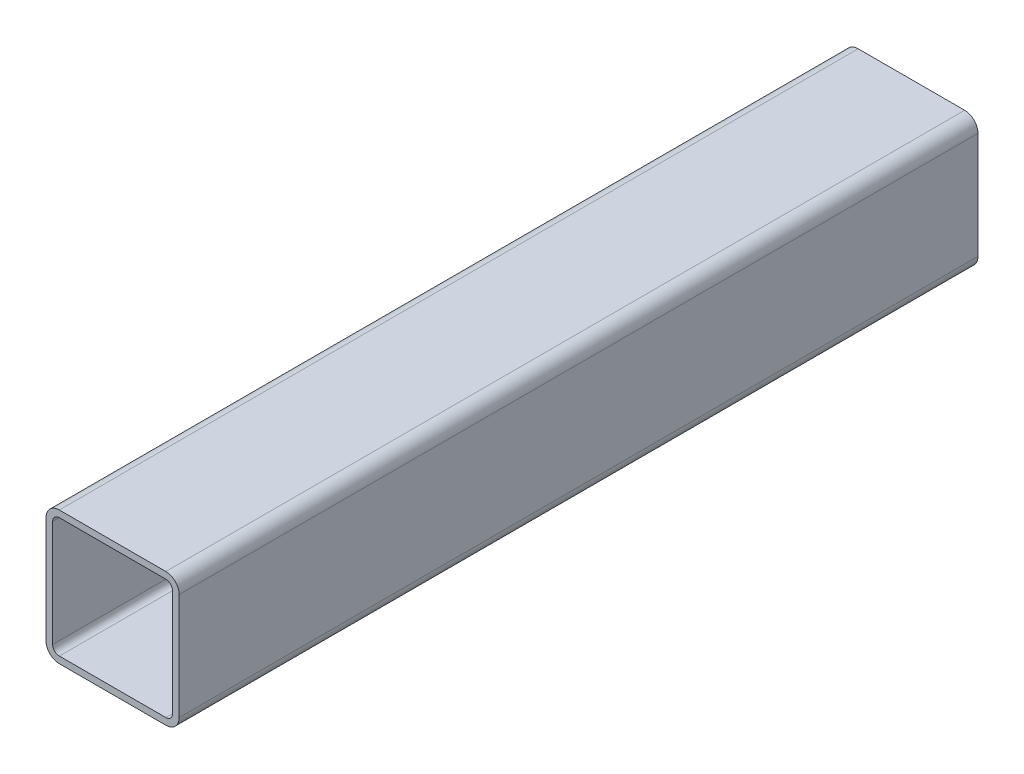
ISO-10303-21;
HEADER;
FILE_DESCRIPTION(('STEP AP214'),'2;1');
FILE_NAME('part.step','',(''),(''),'','','');
FILE_SCHEMA(('AUTOMOTIVE_DESIGN { 1 0 10303 214 1 1 1 1 }'));
ENDSEC;
DATA;
#1=APPLICATION_CONTEXT('core data for automotive mechanical design processes');
#2=APPLICATION_PROTOCOL_DEFINITION('international standard','automotive_design',2000,#1);
#3=PRODUCT_CONTEXT('',#1,'mechanical');
#4=PRODUCT('Part','Part','',(#3));
#5=PRODUCT_RELATED_PRODUCT_CATEGORY('part','',(#4));
#6=PRODUCT_DEFINITION_FORMATION('','',#4);
#7=PRODUCT_DEFINITION_CONTEXT('part definition',#1,'design');
#8=PRODUCT_DEFINITION('design','',#6,#7);
#9=PRODUCT_DEFINITION_SHAPE('','',#8);
#10=(LENGTH_UNIT() NAMED_UNIT(*) SI_UNIT(.MILLI.,.METRE.));
#11=(NAMED_UNIT(*) PLANE_ANGLE_UNIT() SI_UNIT($,.RADIAN.));
#12=(NAMED_UNIT(*) SI_UNIT($,.STERADIAN.) SOLID_ANGLE_UNIT());
#13=UNCERTAINTY_MEASURE_WITH_UNIT(LENGTH_MEASURE(1.E-05),#10,'distance_accuracy_value','');
#14=(GEOMETRIC_REPRESENTATION_CONTEXT(3) GLOBAL_UNCERTAINTY_ASSIGNED_CONTEXT((#13)) GLOBAL_UNIT_ASSIGNED_CONTEXT((#10,
#11,#12)) REPRESENTATION_CONTEXT('',''));
#15=CARTESIAN_POINT('',(0.,0.,0.));
#16=DIRECTION('',(0.,0.,1.));
#17=DIRECTION('',(1.,0.,0.));
#18=AXIS2_PLACEMENT_3D('',#15,#16,#17);
#19=CARTESIAN_POINT('',(-40.,40.,300.));
#20=DIRECTION('',(0.,0.,1.));
#21=DIRECTION('',(1.,0.,0.));
#22=AXIS2_PLACEMENT_3D('',#19,#20,#21);
#23=PLANE('',#22);
#24=CARTESIAN_POINT('',(-40.,40.,300.));
#25=DIRECTION('',(0.,0.,1.));
#26=DIRECTION('',(1.,0.,0.));
#27=AXIS2_PLACEMENT_3D('',#24,#25,#26);
#28=CIRCLE('',#27,10.);
#29=CARTESIAN_POINT('',(-40.,50.,300.));
#30=VERTEX_POINT('',#29);
#31=CARTESIAN_POINT('',(-50.,40.,300.));
#32=VERTEX_POINT('',#31);
#33=EDGE_CURVE('E214',#30,#32,#28,.T.);
#34=ORIENTED_EDGE('',*,*,#33,.T.);
#35=DIRECTION('',(0.,-1.,0.));
#36=VECTOR('',#35,1.);
#37=CARTESIAN_POINT('',(-50.,40.,300.));
#38=LINE('',#37,#36);
#39=CARTESIAN_POINT('',(-50.,-40.0000000000001,300.));
#40=VERTEX_POINT('',#39);
#41=EDGE_CURVE('E217',#32,#40,#38,.T.);
#42=ORIENTED_EDGE('',*,*,#41,.T.);
#43=CARTESIAN_POINT('',(-40.,-40.0000000000001,300.));
#44=DIRECTION('',(0.,0.,1.));
#45=DIRECTION('',(1.,0.,0.));
#46=AXIS2_PLACEMENT_3D('',#43,#44,#45);
#47=CIRCLE('',#46,10.);
#48=CARTESIAN_POINT('',(-40.,-50.0000000000001,300.));
#49=VERTEX_POINT('',#48);
#50=EDGE_CURVE('E220',#40,#49,#47,.T.);
#51=ORIENTED_EDGE('',*,*,#50,.T.);
#52=DIRECTION('',(1.,0.,0.));
#53=VECTOR('',#52,1.);
#54=CARTESIAN_POINT('',(-40.,-50.0000000000001,300.));
#55=LINE('',#54,#53);
#56=CARTESIAN_POINT('',(39.9999999999999,-50.0000000000001,300.));
#57=VERTEX_POINT('',#56);
#58=EDGE_CURVE('E222',#49,#57,#55,.T.);
#59=ORIENTED_EDGE('',*,*,#58,.T.);
#60=CARTESIAN_POINT('',(39.9999999999999,-40.0000000000001,300.));
#61=DIRECTION('',(0.,0.,1.));
#62=DIRECTION('',(1.,0.,0.));
#63=AXIS2_PLACEMENT_3D('',#60,#61,#62);
#64=CIRCLE('',#63,10.);
#65=CARTESIAN_POINT('',(50.,-40.0000000000001,300.));
#66=VERTEX_POINT('',#65);
#67=EDGE_CURVE('E224',#57,#66,#64,.T.);
#68=ORIENTED_EDGE('',*,*,#67,.T.);
#69=DIRECTION('',(0.,1.,0.));
#70=VECTOR('',#69,1.);
#71=CARTESIAN_POINT('',(50.,-40.0000000000001,300.));
#72=LINE('',#71,#70);
#73=CARTESIAN_POINT('',(50.,40.,300.));
#74=VERTEX_POINT('',#73);
#75=EDGE_CURVE('E226',#66,#74,#72,.T.);
#76=ORIENTED_EDGE('',*,*,#75,.T.);
#77=CARTESIAN_POINT('',(39.9999999999999,40.,300.));
#78=DIRECTION('',(0.,0.,1.));
#79=DIRECTION('',(1.,0.,0.));
#80=AXIS2_PLACEMENT_3D('',#77,#78,#79);
#81=CIRCLE('',#80,10.);
#82=CARTESIAN_POINT('',(39.9999999999999,50.,300.));
#83=VERTEX_POINT('',#82);
#84=EDGE_CURVE('E228',#74,#83,#81,.T.);
#85=ORIENTED_EDGE('',*,*,#84,.T.);
#86=DIRECTION('',(-1.,0.,0.));
#87=VECTOR('',#86,1.);
#88=CARTESIAN_POINT('',(39.9999999999999,50.,300.));
#89=LINE('',#88,#87);
#90=EDGE_CURVE('E230',#83,#30,#89,.T.);
#91=ORIENTED_EDGE('',*,*,#90,.T.);
#92=EDGE_LOOP('',(#34,#42,#51,#59,#68,#76,#85,#91));
#93=FACE_BOUND('',#92,.T.);
#94=DIRECTION('',(-1.,0.,0.));
#95=VECTOR('',#94,1.);
#96=CARTESIAN_POINT('',(39.9999999999999,45.,300.));
#97=LINE('',#96,#95);
#98=CARTESIAN_POINT('',(39.9999999999999,45.,300.));
#99=VERTEX_POINT('',#98);
#100=CARTESIAN_POINT('',(-40.,45.,300.));
#101=VERTEX_POINT('',#100);
#102=EDGE_CURVE('E157',#99,#101,#97,.T.);
#103=ORIENTED_EDGE('',*,*,#102,.F.);
#104=CARTESIAN_POINT('',(39.9999999999999,40.,300.));
#105=DIRECTION('',(0.,0.,1.));
#106=DIRECTION('',(1.,0.,0.));
#107=AXIS2_PLACEMENT_3D('',#104,#105,#106);
#108=CIRCLE('',#107,5.00000000000002);
#109=CARTESIAN_POINT('',(45.,40.,300.));
#110=VERTEX_POINT('',#109);
#111=EDGE_CURVE('E149',#110,#99,#108,.T.);
#112=ORIENTED_EDGE('',*,*,#111,.F.);
#113=DIRECTION('',(0.,1.,0.));
#114=VECTOR('',#113,1.);
#115=CARTESIAN_POINT('',(45.,-40.0000000000001,300.));
#116=LINE('',#115,#114);
#117=CARTESIAN_POINT('',(44.9999999999999,-40.0000000000001,300.));
#118=VERTEX_POINT('',#117);
#119=EDGE_CURVE('E182',#118,#110,#116,.T.);
#120=ORIENTED_EDGE('',*,*,#119,.F.);
#121=CARTESIAN_POINT('',(39.9999999999999,-40.0000000000001,300.));
#122=DIRECTION('',(0.,0.,1.));
#123=DIRECTION('',(1.,0.,0.));
#124=AXIS2_PLACEMENT_3D('',#121,#122,#123);
#125=CIRCLE('',#124,5.00000000000001);
#126=CARTESIAN_POINT('',(39.9999999999999,-45.0000000000001,300.));
#127=VERTEX_POINT('',#126);
#128=EDGE_CURVE('E180',#127,#118,#125,.T.);
#129=ORIENTED_EDGE('',*,*,#128,.F.);
#130=DIRECTION('',(1.,0.,0.));
#131=VECTOR('',#130,1.);
#132=CARTESIAN_POINT('',(-40.,-45.0000000000001,300.));
#133=LINE('',#132,#131);
#134=CARTESIAN_POINT('',(-40.,-45.0000000000001,300.));
#135=VERTEX_POINT('',#134);
#136=EDGE_CURVE('E178',#135,#127,#133,.T.);
#137=ORIENTED_EDGE('',*,*,#136,.F.);
#138=CARTESIAN_POINT('',(-40.,-40.0000000000001,300.));
#139=DIRECTION('',(0.,0.,1.));
#140=DIRECTION('',(1.,0.,0.));
#141=AXIS2_PLACEMENT_3D('',#138,#139,#140);
#142=CIRCLE('',#141,5.00000000000001);
#143=CARTESIAN_POINT('',(-45.,-40.0000000000001,300.));
#144=VERTEX_POINT('',#143);
#145=EDGE_CURVE('E176',#144,#135,#142,.T.);
#146=ORIENTED_EDGE('',*,*,#145,.F.);
#147=DIRECTION('',(0.,-1.,0.));
#148=VECTOR('',#147,1.);
#149=CARTESIAN_POINT('',(-45.,40.,300.));
#150=LINE('',#149,#148);
#151=CARTESIAN_POINT('',(-45.,40.,300.));
#152=VERTEX_POINT('',#151);
#153=EDGE_CURVE('E172',#152,#144,#150,.T.);
#154=ORIENTED_EDGE('',*,*,#153,.F.);
#155=CARTESIAN_POINT('',(-40.,40.,300.));
#156=DIRECTION('',(0.,0.,1.));
#157=DIRECTION('',(1.,0.,0.));
#158=AXIS2_PLACEMENT_3D('',#155,#156,#157);
#159=CIRCLE('',#158,5.00000000000001);
#160=EDGE_CURVE('E170',#101,#152,#159,.T.);
#161=ORIENTED_EDGE('',*,*,#160,.F.);
#162=EDGE_LOOP('',(#103,#112,#120,#129,#137,#146,#154,#161));
#163=FACE_BOUND('',#162,.T.);
#164=ADVANCED_FACE('F36',(#93,#163),#23,.T.);
#165=CARTESIAN_POINT('',(-40.,40.,-300.));
#166=DIRECTION('',(0.,0.,1.));
#167=DIRECTION('',(1.,0.,0.));
#168=AXIS2_PLACEMENT_3D('',#165,#166,#167);
#169=PLANE('',#168);
#170=CARTESIAN_POINT('',(-40.,40.,-300.));
#171=DIRECTION('',(0.,0.,1.));
#172=DIRECTION('',(1.,0.,0.));
#173=AXIS2_PLACEMENT_3D('',#170,#171,#172);
#174=CIRCLE('',#173,10.);
#175=CARTESIAN_POINT('',(-40.,50.,-300.));
#176=VERTEX_POINT('',#175);
#177=CARTESIAN_POINT('',(-50.,40.,-300.));
#178=VERTEX_POINT('',#177);
#179=EDGE_CURVE('E165',#176,#178,#174,.T.);
#180=ORIENTED_EDGE('',*,*,#179,.F.);
#181=DIRECTION('',(-1.,0.,0.));
#182=VECTOR('',#181,1.);
#183=CARTESIAN_POINT('',(39.9999999999999,50.,-300.));
#184=LINE('',#183,#182);
#185=CARTESIAN_POINT('',(39.9999999999999,50.,-300.));
#186=VERTEX_POINT('',#185);
#187=EDGE_CURVE('E218',#186,#176,#184,.T.);
#188=ORIENTED_EDGE('',*,*,#187,.F.);
#189=CARTESIAN_POINT('',(39.9999999999999,40.,-300.));
#190=DIRECTION('',(0.,0.,1.));
#191=DIRECTION('',(1.,0.,0.));
#192=AXIS2_PLACEMENT_3D('',#189,#190,#191);
#193=CIRCLE('',#192,10.);
#194=CARTESIAN_POINT('',(50.,40.,-300.));
#195=VERTEX_POINT('',#194);
#196=EDGE_CURVE('E245',#195,#186,#193,.T.);
#197=ORIENTED_EDGE('',*,*,#196,.F.);
#198=DIRECTION('',(0.,1.,0.));
#199=VECTOR('',#198,1.);
#200=CARTESIAN_POINT('',(50.,-40.0000000000001,-300.));
#201=LINE('',#200,#199);
#202=CARTESIAN_POINT('',(50.,-40.0000000000001,-300.));
#203=VERTEX_POINT('',#202);
#204=EDGE_CURVE('E243',#203,#195,#201,.T.);
#205=ORIENTED_EDGE('',*,*,#204,.F.);
#206=CARTESIAN_POINT('',(39.9999999999999,-40.0000000000001,-300.));
#207=DIRECTION('',(0.,0.,1.));
#208=DIRECTION('',(1.,0.,0.));
#209=AXIS2_PLACEMENT_3D('',#206,#207,#208);
#210=CIRCLE('',#209,10.);
#211=CARTESIAN_POINT('',(39.9999999999999,-50.0000000000001,-300.));
#212=VERTEX_POINT('',#211);
#213=EDGE_CURVE('E241',#212,#203,#210,.T.);
#214=ORIENTED_EDGE('',*,*,#213,.F.);
#215=DIRECTION('',(1.,0.,0.));
#216=VECTOR('',#215,1.);
#217=CARTESIAN_POINT('',(-40.,-50.0000000000001,-300.));
#218=LINE('',#217,#216);
#219=CARTESIAN_POINT('',(-40.,-50.0000000000001,-300.));
#220=VERTEX_POINT('',#219);
#221=EDGE_CURVE('E239',#220,#212,#218,.T.);
#222=ORIENTED_EDGE('',*,*,#221,.F.);
#223=CARTESIAN_POINT('',(-40.,-40.0000000000001,-300.));
#224=DIRECTION('',(0.,0.,1.));
#225=DIRECTION('',(1.,0.,0.));
#226=AXIS2_PLACEMENT_3D('',#223,#224,#225);
#227=CIRCLE('',#226,10.);
#228=CARTESIAN_POINT('',(-50.,-40.0000000000001,-300.));
#229=VERTEX_POINT('',#228);
#230=EDGE_CURVE('E237',#229,#220,#227,.T.);
#231=ORIENTED_EDGE('',*,*,#230,.F.);
#232=DIRECTION('',(0.,-1.,0.));
#233=VECTOR('',#232,1.);
#234=CARTESIAN_POINT('',(-50.,40.,-300.));
#235=LINE('',#234,#233);
#236=EDGE_CURVE('E235',#178,#229,#235,.T.);
#237=ORIENTED_EDGE('',*,*,#236,.F.);
#238=EDGE_LOOP('',(#180,#188,#197,#205,#214,#222,#231,#237));
#239=FACE_BOUND('',#238,.T.);
#240=CARTESIAN_POINT('',(39.9999999999999,40.,-300.));
#241=DIRECTION('',(0.,0.,1.));
#242=DIRECTION('',(1.,0.,0.));
#243=AXIS2_PLACEMENT_3D('',#240,#241,#242);
#244=CIRCLE('',#243,5.00000000000002);
#245=CARTESIAN_POINT('',(45.,40.,-300.));
#246=VERTEX_POINT('',#245);
#247=CARTESIAN_POINT('',(39.9999999999999,45.,-300.));
#248=VERTEX_POINT('',#247);
#249=EDGE_CURVE('E59',#246,#248,#244,.T.);
#250=ORIENTED_EDGE('',*,*,#249,.T.);
#251=DIRECTION('',(-1.,0.,0.));
#252=VECTOR('',#251,1.);
#253=CARTESIAN_POINT('',(39.9999999999999,45.,-300.));
#254=LINE('',#253,#252);
#255=CARTESIAN_POINT('',(-40.,45.,-300.));
#256=VERTEX_POINT('',#255);
#257=EDGE_CURVE('E164',#248,#256,#254,.T.);
#258=ORIENTED_EDGE('',*,*,#257,.T.);
#259=CARTESIAN_POINT('',(-40.,40.,-300.));
#260=DIRECTION('',(0.,0.,1.));
#261=DIRECTION('',(1.,0.,0.));
#262=AXIS2_PLACEMENT_3D('',#259,#260,#261);
#263=CIRCLE('',#262,5.00000000000001);
#264=CARTESIAN_POINT('',(-45.,40.,-300.));
#265=VERTEX_POINT('',#264);
#266=EDGE_CURVE('E186',#256,#265,#263,.T.);
#267=ORIENTED_EDGE('',*,*,#266,.T.);
#268=DIRECTION('',(0.,-1.,0.));
#269=VECTOR('',#268,1.);
#270=CARTESIAN_POINT('',(-45.,40.,-300.));
#271=LINE('',#270,#269);
#272=CARTESIAN_POINT('',(-45.,-40.0000000000001,-300.));
#273=VERTEX_POINT('',#272);
#274=EDGE_CURVE('E189',#265,#273,#271,.T.);
#275=ORIENTED_EDGE('',*,*,#274,.T.);
#276=CARTESIAN_POINT('',(-40.,-40.0000000000001,-300.));
#277=DIRECTION('',(0.,0.,1.));
#278=DIRECTION('',(1.,0.,0.));
#279=AXIS2_PLACEMENT_3D('',#276,#277,#278);
#280=CIRCLE('',#279,5.00000000000001);
#281=CARTESIAN_POINT('',(-40.,-45.0000000000001,-300.));
#282=VERTEX_POINT('',#281);
#283=EDGE_CURVE('E192',#273,#282,#280,.T.);
#284=ORIENTED_EDGE('',*,*,#283,.T.);
#285=DIRECTION('',(1.,0.,0.));
#286=VECTOR('',#285,1.);
#287=CARTESIAN_POINT('',(-40.,-45.0000000000001,-300.));
#288=LINE('',#287,#286);
#289=CARTESIAN_POINT('',(39.9999999999999,-45.0000000000001,-300.));
#290=VERTEX_POINT('',#289);
#291=EDGE_CURVE('E195',#282,#290,#288,.T.);
#292=ORIENTED_EDGE('',*,*,#291,.T.);
#293=CARTESIAN_POINT('',(39.9999999999999,-40.0000000000001,-300.));
#294=DIRECTION('',(0.,0.,1.));
#295=DIRECTION('',(1.,0.,0.));
#296=AXIS2_PLACEMENT_3D('',#293,#294,#295);
#297=CIRCLE('',#296,5.00000000000001);
#298=CARTESIAN_POINT('',(45.,-40.0000000000001,-300.));
#299=VERTEX_POINT('',#298);
#300=EDGE_CURVE('E198',#290,#299,#297,.T.);
#301=ORIENTED_EDGE('',*,*,#300,.T.);
#302=DIRECTION('',(0.,1.,0.));
#303=VECTOR('',#302,1.);
#304=CARTESIAN_POINT('',(45.,-40.0000000000001,-300.));
#305=LINE('',#304,#303);
#306=EDGE_CURVE('E158',#299,#246,#305,.T.);
#307=ORIENTED_EDGE('',*,*,#306,.T.);
#308=EDGE_LOOP('',(#250,#258,#267,#275,#284,#292,#301,#307));
#309=FACE_BOUND('',#308,.T.);
#310=ADVANCED_FACE('F275',(#239,#309),#169,.F.);
#311=CARTESIAN_POINT('',(-40.,40.,300.));
#312=DIRECTION('',(0.,0.,-1.));
#313=DIRECTION('',(-1.,0.,0.));
#314=AXIS2_PLACEMENT_3D('',#311,#312,#313);
#315=CYLINDRICAL_SURFACE('',#314,10.);
#316=ORIENTED_EDGE('',*,*,#179,.T.);
#317=DIRECTION('',(0.,0.,-1.));
#318=VECTOR('',#317,1.);
#319=CARTESIAN_POINT('',(-50.,40.,300.));
#320=LINE('',#319,#318);
#321=EDGE_CURVE('E11',#32,#178,#320,.T.);
#322=ORIENTED_EDGE('',*,*,#321,.F.);
#323=ORIENTED_EDGE('',*,*,#33,.F.);
#324=DIRECTION('',(0.,0.,-1.));
#325=VECTOR('',#324,1.);
#326=CARTESIAN_POINT('',(-40.,50.,300.));
#327=LINE('',#326,#325);
#328=EDGE_CURVE('E232',#30,#176,#327,.T.);
#329=ORIENTED_EDGE('',*,*,#328,.T.);
#330=EDGE_LOOP('',(#316,#322,#323,#329));
#331=FACE_BOUND('',#330,.T.);
#332=ADVANCED_FACE('F38',(#331),#315,.T.);
#333=CARTESIAN_POINT('',(-50.,40.,300.));
#334=DIRECTION('',(1.,0.,0.));
#335=DIRECTION('',(0.,0.,-1.));
#336=AXIS2_PLACEMENT_3D('',#333,#334,#335);
#337=PLANE('',#336);
#338=ORIENTED_EDGE('',*,*,#236,.T.);
#339=DIRECTION('',(0.,0.,-1.));
#340=VECTOR('',#339,1.);
#341=CARTESIAN_POINT('',(-50.,-40.0000000000001,300.));
#342=LINE('',#341,#340);
#343=EDGE_CURVE('E44',#40,#229,#342,.T.);
#344=ORIENTED_EDGE('',*,*,#343,.F.);
#345=ORIENTED_EDGE('',*,*,#41,.F.);
#346=ORIENTED_EDGE('',*,*,#321,.T.);
#347=EDGE_LOOP('',(#338,#344,#345,#346));
#348=FACE_BOUND('',#347,.T.);
#349=ADVANCED_FACE('F292',(#348),#337,.F.);
#350=CARTESIAN_POINT('',(-40.,-40.0000000000001,300.));
#351=DIRECTION('',(0.,0.,-1.));
#352=DIRECTION('',(-1.,0.,0.));
#353=AXIS2_PLACEMENT_3D('',#350,#351,#352);
#354=CYLINDRICAL_SURFACE('',#353,10.);
#355=ORIENTED_EDGE('',*,*,#230,.T.);
#356=DIRECTION('',(0.,0.,-1.));
#357=VECTOR('',#356,1.);
#358=CARTESIAN_POINT('',(-40.,-50.0000000000001,300.));
#359=LINE('',#358,#357);
#360=EDGE_CURVE('E262',#49,#220,#359,.T.);
#361=ORIENTED_EDGE('',*,*,#360,.F.);
#362=ORIENTED_EDGE('',*,*,#50,.F.);
#363=ORIENTED_EDGE('',*,*,#343,.T.);
#364=EDGE_LOOP('',(#355,#361,#362,#363));
#365=FACE_BOUND('',#364,.T.);
#366=ADVANCED_FACE('F269',(#365),#354,.T.);
#367=CARTESIAN_POINT('',(-40.,-50.0000000000001,300.));
#368=DIRECTION('',(0.,1.,0.));
#369=DIRECTION('',(0.,0.,1.));
#370=AXIS2_PLACEMENT_3D('',#367,#368,#369);
#371=PLANE('',#370);
#372=ORIENTED_EDGE('',*,*,#221,.T.);
#373=DIRECTION('',(0.,0.,-1.));
#374=VECTOR('',#373,1.);
#375=CARTESIAN_POINT('',(39.9999999999999,-50.0000000000001,300.));
#376=LINE('',#375,#374);
#377=EDGE_CURVE('E259',#57,#212,#376,.T.);
#378=ORIENTED_EDGE('',*,*,#377,.F.);
#379=ORIENTED_EDGE('',*,*,#58,.F.);
#380=ORIENTED_EDGE('',*,*,#360,.T.);
#381=EDGE_LOOP('',(#372,#378,#379,#380));
#382=FACE_BOUND('',#381,.T.);
#383=ADVANCED_FACE('F281',(#382),#371,.F.);
#384=CARTESIAN_POINT('',(39.9999999999999,-40.0000000000001,300.));
#385=DIRECTION('',(0.,0.,-1.));
#386=DIRECTION('',(-1.,0.,0.));
#387=AXIS2_PLACEMENT_3D('',#384,#385,#386);
#388=CYLINDRICAL_SURFACE('',#387,10.);
#389=ORIENTED_EDGE('',*,*,#213,.T.);
#390=DIRECTION('',(0.,0.,-1.));
#391=VECTOR('',#390,1.);
#392=CARTESIAN_POINT('',(50.,-40.0000000000001,300.));
#393=LINE('',#392,#391);
#394=EDGE_CURVE('E256',#66,#203,#393,.T.);
#395=ORIENTED_EDGE('',*,*,#394,.F.);
#396=ORIENTED_EDGE('',*,*,#67,.F.);
#397=ORIENTED_EDGE('',*,*,#377,.T.);
#398=EDGE_LOOP('',(#389,#395,#396,#397));
#399=FACE_BOUND('',#398,.T.);
#400=ADVANCED_FACE('F285',(#399),#388,.T.);
#401=CARTESIAN_POINT('',(50.,-40.0000000000001,300.));
#402=DIRECTION('',(-1.,0.,0.));
#403=DIRECTION('',(0.,0.,1.));
#404=AXIS2_PLACEMENT_3D('',#401,#402,#403);
#405=PLANE('',#404);
#406=ORIENTED_EDGE('',*,*,#204,.T.);
#407=DIRECTION('',(0.,0.,-1.));
#408=VECTOR('',#407,1.);
#409=CARTESIAN_POINT('',(50.,40.,300.));
#410=LINE('',#409,#408);
#411=EDGE_CURVE('E253',#74,#195,#410,.T.);
#412=ORIENTED_EDGE('',*,*,#411,.F.);
#413=ORIENTED_EDGE('',*,*,#75,.F.);
#414=ORIENTED_EDGE('',*,*,#394,.T.);
#415=EDGE_LOOP('',(#406,#412,#413,#414));
#416=FACE_BOUND('',#415,.T.);
#417=ADVANCED_FACE('F305',(#416),#405,.F.);
#418=CARTESIAN_POINT('',(39.9999999999999,40.,300.));
#419=DIRECTION('',(0.,0.,-1.));
#420=DIRECTION('',(-1.,0.,0.));
#421=AXIS2_PLACEMENT_3D('',#418,#419,#420);
#422=CYLINDRICAL_SURFACE('',#421,10.);
#423=ORIENTED_EDGE('',*,*,#196,.T.);
#424=DIRECTION('',(0.,0.,-1.));
#425=VECTOR('',#424,1.);
#426=CARTESIAN_POINT('',(39.9999999999999,50.,300.));
#427=LINE('',#426,#425);
#428=EDGE_CURVE('E250',#83,#186,#427,.T.);
#429=ORIENTED_EDGE('',*,*,#428,.F.);
#430=ORIENTED_EDGE('',*,*,#84,.F.);
#431=ORIENTED_EDGE('',*,*,#411,.T.);
#432=EDGE_LOOP('',(#423,#429,#430,#431));
#433=FACE_BOUND('',#432,.T.);
#434=ADVANCED_FACE('F303',(#433),#422,.T.);
#435=CARTESIAN_POINT('',(39.9999999999999,50.,300.));
#436=DIRECTION('',(0.,-1.,0.));
#437=DIRECTION('',(0.,0.,-1.));
#438=AXIS2_PLACEMENT_3D('',#435,#436,#437);
#439=PLANE('',#438);
#440=ORIENTED_EDGE('',*,*,#187,.T.);
#441=ORIENTED_EDGE('',*,*,#328,.F.);
#442=ORIENTED_EDGE('',*,*,#90,.F.);
#443=ORIENTED_EDGE('',*,*,#428,.T.);
#444=EDGE_LOOP('',(#440,#441,#442,#443));
#445=FACE_BOUND('',#444,.T.);
#446=ADVANCED_FACE('F298',(#445),#439,.F.);
#447=CARTESIAN_POINT('',(39.9999999999999,40.,300.));
#448=DIRECTION('',(0.,0.,-1.));
#449=DIRECTION('',(-1.,0.,0.));
#450=AXIS2_PLACEMENT_3D('',#447,#448,#449);
#451=CYLINDRICAL_SURFACE('',#450,5.00000000000002);
#452=ORIENTED_EDGE('',*,*,#249,.F.);
#453=DIRECTION('',(0.,0.,-1.));
#454=VECTOR('',#453,1.);
#455=CARTESIAN_POINT('',(45.,40.,300.));
#456=LINE('',#455,#454);
#457=EDGE_CURVE('E153',#110,#246,#456,.T.);
#458=ORIENTED_EDGE('',*,*,#457,.F.);
#459=ORIENTED_EDGE('',*,*,#111,.T.);
#460=DIRECTION('',(0.,0.,-1.));
#461=VECTOR('',#460,1.);
#462=CARTESIAN_POINT('',(39.9999999999999,45.,300.));
#463=LINE('',#462,#461);
#464=EDGE_CURVE('E152',#99,#248,#463,.T.);
#465=ORIENTED_EDGE('',*,*,#464,.T.);
#466=EDGE_LOOP('',(#452,#458,#459,#465));
#467=FACE_BOUND('',#466,.T.);
#468=ADVANCED_FACE('F151',(#467),#451,.F.);
#469=CARTESIAN_POINT('',(39.9999999999999,45.,300.));
#470=DIRECTION('',(0.,-1.,0.));
#471=DIRECTION('',(0.,0.,-1.));
#472=AXIS2_PLACEMENT_3D('',#469,#470,#471);
#473=PLANE('',#472);
#474=ORIENTED_EDGE('',*,*,#257,.F.);
#475=ORIENTED_EDGE('',*,*,#464,.F.);
#476=ORIENTED_EDGE('',*,*,#102,.T.);
#477=DIRECTION('',(0.,0.,-1.));
#478=VECTOR('',#477,1.);
#479=CARTESIAN_POINT('',(-40.,45.,300.));
#480=LINE('',#479,#478);
#481=EDGE_CURVE('E166',#101,#256,#480,.T.);
#482=ORIENTED_EDGE('',*,*,#481,.T.);
#483=EDGE_LOOP('',(#474,#475,#476,#482));
#484=FACE_BOUND('',#483,.T.);
#485=ADVANCED_FACE('F161',(#484),#473,.T.);
#486=CARTESIAN_POINT('',(-40.,40.,300.));
#487=DIRECTION('',(0.,0.,-1.));
#488=DIRECTION('',(-1.,0.,0.));
#489=AXIS2_PLACEMENT_3D('',#486,#487,#488);
#490=CYLINDRICAL_SURFACE('',#489,5.00000000000001);
#491=ORIENTED_EDGE('',*,*,#266,.F.);
#492=ORIENTED_EDGE('',*,*,#481,.F.);
#493=ORIENTED_EDGE('',*,*,#160,.T.);
#494=DIRECTION('',(0.,0.,-1.));
#495=VECTOR('',#494,1.);
#496=CARTESIAN_POINT('',(-45.,40.,300.));
#497=LINE('',#496,#495);
#498=EDGE_CURVE('E211',#152,#265,#497,.T.);
#499=ORIENTED_EDGE('',*,*,#498,.T.);
#500=EDGE_LOOP('',(#491,#492,#493,#499));
#501=FACE_BOUND('',#500,.T.);
#502=ADVANCED_FACE('F330',(#501),#490,.F.);
#503=CARTESIAN_POINT('',(-45.,40.,300.));
#504=DIRECTION('',(1.,0.,0.));
#505=DIRECTION('',(0.,0.,-1.));
#506=AXIS2_PLACEMENT_3D('',#503,#504,#505);
#507=PLANE('',#506);
#508=ORIENTED_EDGE('',*,*,#274,.F.);
#509=ORIENTED_EDGE('',*,*,#498,.F.);
#510=ORIENTED_EDGE('',*,*,#153,.T.);
#511=DIRECTION('',(0.,0.,-1.));
#512=VECTOR('',#511,1.);
#513=CARTESIAN_POINT('',(-45.,-40.0000000000001,300.));
#514=LINE('',#513,#512);
#515=EDGE_CURVE('E209',#144,#273,#514,.T.);
#516=ORIENTED_EDGE('',*,*,#515,.T.);
#517=EDGE_LOOP('',(#508,#509,#510,#516));
#518=FACE_BOUND('',#517,.T.);
#519=ADVANCED_FACE('F334',(#518),#507,.T.);
#520=CARTESIAN_POINT('',(-40.,-40.0000000000001,300.));
#521=DIRECTION('',(0.,0.,-1.));
#522=DIRECTION('',(-1.,0.,0.));
#523=AXIS2_PLACEMENT_3D('',#520,#521,#522);
#524=CYLINDRICAL_SURFACE('',#523,5.00000000000001);
#525=ORIENTED_EDGE('',*,*,#283,.F.);
#526=ORIENTED_EDGE('',*,*,#515,.F.);
#527=ORIENTED_EDGE('',*,*,#145,.T.);
#528=DIRECTION('',(0.,0.,-1.));
#529=VECTOR('',#528,1.);
#530=CARTESIAN_POINT('',(-40.,-45.0000000000001,300.));
#531=LINE('',#530,#529);
#532=EDGE_CURVE('E207',#135,#282,#531,.T.);
#533=ORIENTED_EDGE('',*,*,#532,.T.);
#534=EDGE_LOOP('',(#525,#526,#527,#533));
#535=FACE_BOUND('',#534,.T.);
#536=ADVANCED_FACE('F340',(#535),#524,.F.);
#537=CARTESIAN_POINT('',(-40.,-45.0000000000001,300.));
#538=DIRECTION('',(0.,1.,0.));
#539=DIRECTION('',(0.,0.,1.));
#540=AXIS2_PLACEMENT_3D('',#537,#538,#539);
#541=PLANE('',#540);
#542=ORIENTED_EDGE('',*,*,#291,.F.);
#543=ORIENTED_EDGE('',*,*,#532,.F.);
#544=ORIENTED_EDGE('',*,*,#136,.T.);
#545=DIRECTION('',(0.,0.,-1.));
#546=VECTOR('',#545,1.);
#547=CARTESIAN_POINT('',(39.9999999999999,-45.0000000000001,300.));
#548=LINE('',#547,#546);
#549=EDGE_CURVE('E205',#127,#290,#548,.T.);
#550=ORIENTED_EDGE('',*,*,#549,.T.);
#551=EDGE_LOOP('',(#542,#543,#544,#550));
#552=FACE_BOUND('',#551,.T.);
#553=ADVANCED_FACE('F344',(#552),#541,.T.);
#554=CARTESIAN_POINT('',(39.9999999999999,-40.0000000000001,300.));
#555=DIRECTION('',(0.,0.,-1.));
#556=DIRECTION('',(-1.,0.,0.));
#557=AXIS2_PLACEMENT_3D('',#554,#555,#556);
#558=CYLINDRICAL_SURFACE('',#557,5.00000000000001);
#559=ORIENTED_EDGE('',*,*,#300,.F.);
#560=ORIENTED_EDGE('',*,*,#549,.F.);
#561=ORIENTED_EDGE('',*,*,#128,.T.);
#562=DIRECTION('',(0.,0.,-1.));
#563=VECTOR('',#562,1.);
#564=CARTESIAN_POINT('',(45.,-40.0000000000001,300.));
#565=LINE('',#564,#563);
#566=EDGE_CURVE('E51',#118,#299,#565,.T.);
#567=ORIENTED_EDGE('',*,*,#566,.T.);
#568=EDGE_LOOP('',(#559,#560,#561,#567));
#569=FACE_BOUND('',#568,.T.);
#570=ADVANCED_FACE('F348',(#569),#558,.F.);
#571=CARTESIAN_POINT('',(45.,-40.0000000000001,300.));
#572=DIRECTION('',(-1.,0.,0.));
#573=DIRECTION('',(0.,-1.,0.));
#574=AXIS2_PLACEMENT_3D('',#571,#572,#573);
#575=PLANE('',#574);
#576=ORIENTED_EDGE('',*,*,#306,.F.);
#577=ORIENTED_EDGE('',*,*,#566,.F.);
#578=ORIENTED_EDGE('',*,*,#119,.T.);
#579=ORIENTED_EDGE('',*,*,#457,.T.);
#580=EDGE_LOOP('',(#576,#577,#578,#579));
#581=FACE_BOUND('',#580,.T.);
#582=ADVANCED_FACE('F352',(#581),#575,.T.);
#583=CLOSED_SHELL('',(#164,#310,#332,#349,#366,#383,#400,#417,#434,#446,#468,#485,#502,#519,
#536,#553,#570,#582));
#584=MANIFOLD_SOLID_BREP('B2',#583);
#585=ADVANCED_BREP_SHAPE_REPRESENTATION('',(#18,#584),#14);
#586=SHAPE_DEFINITION_REPRESENTATION(#9,#585);
ENDSEC;
END-ISO-10303-21;
